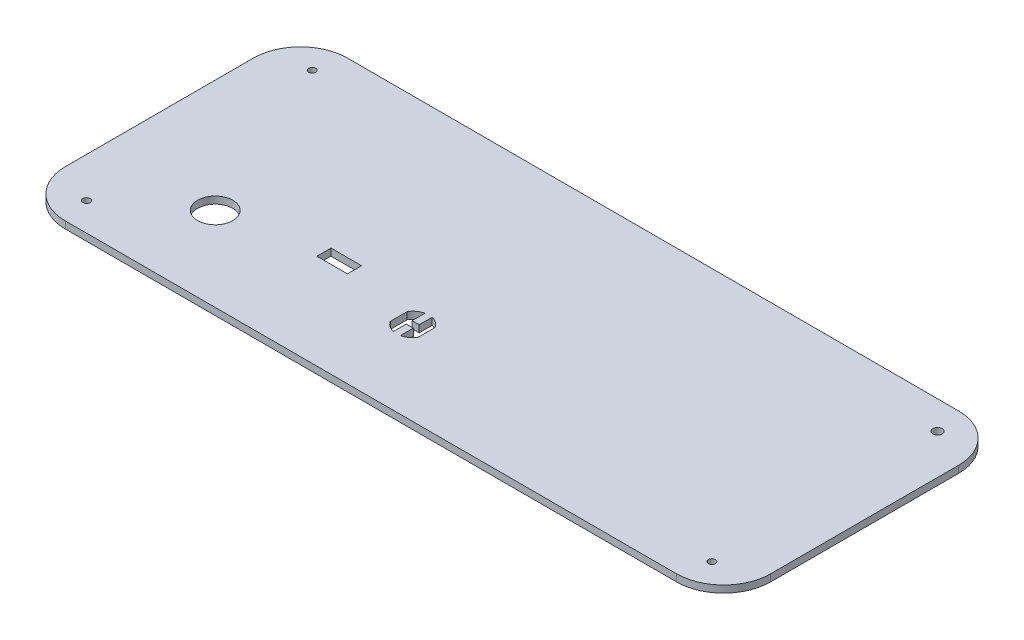
ISO-10303-21;
HEADER;
FILE_DESCRIPTION(('STEP AP214'),'2;1');
FILE_NAME('part.step','',(''),(''),'','','');
FILE_SCHEMA(('AUTOMOTIVE_DESIGN { 1 0 10303 214 1 1 1 1 }'));
ENDSEC;
DATA;
#1=APPLICATION_CONTEXT('core data for automotive mechanical design processes');
#2=APPLICATION_PROTOCOL_DEFINITION('international standard','automotive_design',2000,#1);
#3=PRODUCT_CONTEXT('',#1,'mechanical');
#4=PRODUCT('Part','Part','',(#3));
#5=PRODUCT_RELATED_PRODUCT_CATEGORY('part','',(#4));
#6=PRODUCT_DEFINITION_FORMATION('','',#4);
#7=PRODUCT_DEFINITION_CONTEXT('part definition',#1,'design');
#8=PRODUCT_DEFINITION('design','',#6,#7);
#9=PRODUCT_DEFINITION_SHAPE('','',#8);
#10=(LENGTH_UNIT() NAMED_UNIT(*) SI_UNIT(.MILLI.,.METRE.));
#11=(NAMED_UNIT(*) PLANE_ANGLE_UNIT() SI_UNIT($,.RADIAN.));
#12=(NAMED_UNIT(*) SI_UNIT($,.STERADIAN.) SOLID_ANGLE_UNIT());
#13=UNCERTAINTY_MEASURE_WITH_UNIT(LENGTH_MEASURE(1.E-05),#10,'distance_accuracy_value','');
#14=(GEOMETRIC_REPRESENTATION_CONTEXT(3) GLOBAL_UNCERTAINTY_ASSIGNED_CONTEXT((#13)) GLOBAL_UNIT_ASSIGNED_CONTEXT((#10,
#11,#12)) REPRESENTATION_CONTEXT('',''));
#15=CARTESIAN_POINT('',(0.,0.,0.));
#16=DIRECTION('',(0.,0.,1.));
#17=DIRECTION('',(1.,0.,0.));
#18=AXIS2_PLACEMENT_3D('',#15,#16,#17);
#19=CARTESIAN_POINT('',(0.,3.,0.));
#20=DIRECTION('',(0.,1.,0.));
#21=DIRECTION('',(0.,0.,1.));
#22=AXIS2_PLACEMENT_3D('',#19,#20,#21);
#23=PLANE('',#22);
#24=DIRECTION('',(0.,0.,-1.));
#25=VECTOR('',#24,1.);
#26=CARTESIAN_POINT('',(-200.5,3.,-46.4964857041005));
#27=LINE('',#26,#25);
#28=CARTESIAN_POINT('',(-200.5,3.,-40.4964857041005));
#29=VERTEX_POINT('',#28);
#30=CARTESIAN_POINT('',(-200.5,3.,-46.4964857041005));
#31=VERTEX_POINT('',#30);
#32=EDGE_CURVE('E208',#29,#31,#27,.T.);
#33=ORIENTED_EDGE('',*,*,#32,.F.);
#34=DIRECTION('',(1.,0.,0.));
#35=VECTOR('',#34,1.);
#36=CARTESIAN_POINT('',(-213.5,3.,-40.4964857041004));
#37=LINE('',#36,#35);
#38=CARTESIAN_POINT('',(-213.5,3.,-40.4964857041004));
#39=VERTEX_POINT('',#38);
#40=EDGE_CURVE('E198',#39,#29,#37,.T.);
#41=ORIENTED_EDGE('',*,*,#40,.F.);
#42=DIRECTION('',(0.,0.,1.));
#43=VECTOR('',#42,1.);
#44=CARTESIAN_POINT('',(-213.5,3.,-46.4964857041005));
#45=LINE('',#44,#43);
#46=CARTESIAN_POINT('',(-213.5,3.,-46.4964857041005));
#47=VERTEX_POINT('',#46);
#48=EDGE_CURVE('E224',#47,#39,#45,.T.);
#49=ORIENTED_EDGE('',*,*,#48,.F.);
#50=DIRECTION('',(-1.,0.,0.));
#51=VECTOR('',#50,1.);
#52=CARTESIAN_POINT('',(-213.5,3.,-46.4964857041005));
#53=LINE('',#52,#51);
#54=EDGE_CURVE('E222',#31,#47,#53,.T.);
#55=ORIENTED_EDGE('',*,*,#54,.F.);
#56=EDGE_LOOP('',(#33,#41,#49,#55));
#57=FACE_BOUND('',#56,.T.);
#58=DIRECTION('',(0.,0.,-1.));
#59=VECTOR('',#58,1.);
#60=CARTESIAN_POINT('',(-162.100000000001,3.,-39.3241944681029));
#61=LINE('',#60,#59);
#62=CARTESIAN_POINT('',(-162.100000000001,3.,-32.168776940098));
#63=VERTEX_POINT('',#62);
#64=CARTESIAN_POINT('',(-162.100000000001,3.,-39.3241944681029));
#65=VERTEX_POINT('',#64);
#66=EDGE_CURVE('E244',#63,#65,#61,.T.);
#67=ORIENTED_EDGE('',*,*,#66,.F.);
#68=CARTESIAN_POINT('',(-168.000000000001,3.,-35.7464857041005));
#69=DIRECTION('',(0.,1.,0.));
#70=DIRECTION('',(0.,0.,1.));
#71=AXIS2_PLACEMENT_3D('',#68,#69,#70);
#72=CIRCLE('',#71,6.90000000000143);
#73=CARTESIAN_POINT('',(-166.500000000001,3.,-29.0115024079059));
#74=VERTEX_POINT('',#73);
#75=EDGE_CURVE('E242',#74,#63,#72,.T.);
#76=ORIENTED_EDGE('',*,*,#75,.F.);
#77=DIRECTION('',(0.,0.,1.));
#78=VECTOR('',#77,1.);
#79=CARTESIAN_POINT('',(-166.500000000001,3.,-34.4964857041005));
#80=LINE('',#79,#78);
#81=CARTESIAN_POINT('',(-166.500000000001,3.,-34.4964857041005));
#82=VERTEX_POINT('',#81);
#83=EDGE_CURVE('E266',#82,#74,#80,.T.);
#84=ORIENTED_EDGE('',*,*,#83,.F.);
#85=DIRECTION('',(1.,0.,0.));
#86=VECTOR('',#85,1.);
#87=CARTESIAN_POINT('',(-169.500000000001,3.,-34.4964857041005));
#88=LINE('',#87,#86);
#89=CARTESIAN_POINT('',(-169.500000000001,3.,-34.4964857041005));
#90=VERTEX_POINT('',#89);
#91=EDGE_CURVE('E263',#90,#82,#88,.T.);
#92=ORIENTED_EDGE('',*,*,#91,.F.);
#93=DIRECTION('',(0.,0.,-1.));
#94=VECTOR('',#93,1.);
#95=CARTESIAN_POINT('',(-169.500000000001,3.,-34.4964857041005));
#96=LINE('',#95,#94);
#97=CARTESIAN_POINT('',(-169.500000000001,3.,-29.0115024079059));
#98=VERTEX_POINT('',#97);
#99=EDGE_CURVE('E261',#98,#90,#96,.T.);
#100=ORIENTED_EDGE('',*,*,#99,.F.);
#101=CARTESIAN_POINT('',(-168.000000000001,3.,-35.7464857041005));
#102=DIRECTION('',(0.,1.,0.));
#103=DIRECTION('',(0.,0.,1.));
#104=AXIS2_PLACEMENT_3D('',#101,#102,#103);
#105=CIRCLE('',#104,6.90000000000143);
#106=CARTESIAN_POINT('',(-173.900000000001,3.,-32.168776940098));
#107=VERTEX_POINT('',#106);
#108=EDGE_CURVE('E259',#107,#98,#105,.T.);
#109=ORIENTED_EDGE('',*,*,#108,.F.);
#110=DIRECTION('',(0.,0.,1.));
#111=VECTOR('',#110,1.);
#112=CARTESIAN_POINT('',(-173.900000000001,3.,-39.3241944681029));
#113=LINE('',#112,#111);
#114=CARTESIAN_POINT('',(-173.900000000001,3.,-39.3241944681029));
#115=VERTEX_POINT('',#114);
#116=EDGE_CURVE('E257',#115,#107,#113,.T.);
#117=ORIENTED_EDGE('',*,*,#116,.F.);
#118=CARTESIAN_POINT('',(-168.000000000001,3.,-35.7464857041005));
#119=DIRECTION('',(0.,1.,0.));
#120=DIRECTION('',(0.,0.,1.));
#121=AXIS2_PLACEMENT_3D('',#118,#119,#120);
#122=CIRCLE('',#121,6.90000000000143);
#123=CARTESIAN_POINT('',(-169.500000000001,3.,-42.481469000295));
#124=VERTEX_POINT('',#123);
#125=EDGE_CURVE('E255',#124,#115,#122,.T.);
#126=ORIENTED_EDGE('',*,*,#125,.F.);
#127=DIRECTION('',(0.,0.,-1.));
#128=VECTOR('',#127,1.);
#129=CARTESIAN_POINT('',(-169.500000000001,3.,-42.481469000295));
#130=LINE('',#129,#128);
#131=CARTESIAN_POINT('',(-169.500000000001,3.,-36.9964857041005));
#132=VERTEX_POINT('',#131);
#133=EDGE_CURVE('E253',#132,#124,#130,.T.);
#134=ORIENTED_EDGE('',*,*,#133,.F.);
#135=DIRECTION('',(-1.,0.,-2.91433543964101E-13));
#136=VECTOR('',#135,1.);
#137=CARTESIAN_POINT('',(-169.500000000001,3.,-36.9964857041005));
#138=LINE('',#137,#136);
#139=CARTESIAN_POINT('',(-166.500000000001,3.,-36.9964857040996));
#140=VERTEX_POINT('',#139);
#141=EDGE_CURVE('E251',#140,#132,#138,.T.);
#142=ORIENTED_EDGE('',*,*,#141,.F.);
#143=DIRECTION('',(0.,0.,1.));
#144=VECTOR('',#143,1.);
#145=CARTESIAN_POINT('',(-166.500000000001,3.,-42.481469000295));
#146=LINE('',#145,#144);
#147=CARTESIAN_POINT('',(-166.500000000001,3.,-42.481469000295));
#148=VERTEX_POINT('',#147);
#149=EDGE_CURVE('E249',#148,#140,#146,.T.);
#150=ORIENTED_EDGE('',*,*,#149,.F.);
#151=CARTESIAN_POINT('',(-168.000000000001,3.,-35.7464857041005));
#152=DIRECTION('',(0.,1.,0.));
#153=DIRECTION('',(0.,0.,1.));
#154=AXIS2_PLACEMENT_3D('',#151,#152,#153);
#155=CIRCLE('',#154,6.90000000000143);
#156=EDGE_CURVE('E247',#65,#148,#155,.T.);
#157=ORIENTED_EDGE('',*,*,#156,.F.);
#158=EDGE_LOOP('',(#67,#76,#84,#92,#100,#109,#117,#126,#134,#142,#150,#157));
#159=FACE_BOUND('',#158,.T.);
#160=CARTESIAN_POINT('',(-283.,3.,-12.));
#161=DIRECTION('',(0.,1.,0.));
#162=DIRECTION('',(0.,0.,1.));
#163=AXIS2_PLACEMENT_3D('',#160,#161,#162);
#164=CIRCLE('',#163,1.50000000000002);
#165=CARTESIAN_POINT('',(-283.,3.,-10.5));
#166=VERTEX_POINT('',#165);
#167=EDGE_CURVE('E329',#166,#166,#164,.T.);
#168=ORIENTED_EDGE('',*,*,#167,.F.);
#169=EDGE_LOOP('',(#168));
#170=FACE_BOUND('',#169,.T.);
#171=CARTESIAN_POINT('',(-17.,3.,-108.));
#172=DIRECTION('',(0.,1.,0.));
#173=DIRECTION('',(0.,0.,1.));
#174=AXIS2_PLACEMENT_3D('',#171,#172,#173);
#175=CIRCLE('',#174,2.);
#176=CARTESIAN_POINT('',(-17.,3.,-106.));
#177=VERTEX_POINT('',#176);
#178=EDGE_CURVE('E341',#177,#177,#175,.T.);
#179=ORIENTED_EDGE('',*,*,#178,.F.);
#180=EDGE_LOOP('',(#179));
#181=FACE_BOUND('',#180,.T.);
#182=DIRECTION('',(-1.,0.,0.));
#183=VECTOR('',#182,1.);
#184=CARTESIAN_POINT('',(0.,3.,-120.));
#185=LINE('',#184,#183);
#186=CARTESIAN_POINT('',(-20.,3.,-120.));
#187=VERTEX_POINT('',#186);
#188=CARTESIAN_POINT('',(-280.,3.,-120.));
#189=VERTEX_POINT('',#188);
#190=EDGE_CURVE('E356',#187,#189,#185,.T.);
#191=ORIENTED_EDGE('',*,*,#190,.T.);
#192=CARTESIAN_POINT('',(-280.,3.,-100.));
#193=DIRECTION('',(0.,1.,0.));
#194=DIRECTION('',(0.,0.,1.));
#195=AXIS2_PLACEMENT_3D('',#192,#193,#194);
#196=CIRCLE('',#195,20.);
#197=CARTESIAN_POINT('',(-300.,3.,-100.));
#198=VERTEX_POINT('',#197);
#199=EDGE_CURVE('E396',#189,#198,#196,.T.);
#200=ORIENTED_EDGE('',*,*,#199,.T.);
#201=DIRECTION('',(0.,0.,1.));
#202=VECTOR('',#201,1.);
#203=CARTESIAN_POINT('',(-300.,3.,0.));
#204=LINE('',#203,#202);
#205=CARTESIAN_POINT('',(-300.,3.,-20.));
#206=VERTEX_POINT('',#205);
#207=EDGE_CURVE('E360',#198,#206,#204,.T.);
#208=ORIENTED_EDGE('',*,*,#207,.T.);
#209=CARTESIAN_POINT('',(-280.,3.,-20.));
#210=DIRECTION('',(0.,1.,0.));
#211=DIRECTION('',(0.,0.,1.));
#212=AXIS2_PLACEMENT_3D('',#209,#210,#211);
#213=CIRCLE('',#212,20.);
#214=CARTESIAN_POINT('',(-280.,3.,0.));
#215=VERTEX_POINT('',#214);
#216=EDGE_CURVE('E56',#206,#215,#213,.T.);
#217=ORIENTED_EDGE('',*,*,#216,.T.);
#218=DIRECTION('',(1.,0.,0.));
#219=VECTOR('',#218,1.);
#220=CARTESIAN_POINT('',(0.,3.,0.));
#221=LINE('',#220,#219);
#222=CARTESIAN_POINT('',(-20.,3.,0.));
#223=VERTEX_POINT('',#222);
#224=EDGE_CURVE('E362',#215,#223,#221,.T.);
#225=ORIENTED_EDGE('',*,*,#224,.T.);
#226=CARTESIAN_POINT('',(-20.,3.,-20.));
#227=DIRECTION('',(0.,1.,0.));
#228=DIRECTION('',(0.,0.,1.));
#229=AXIS2_PLACEMENT_3D('',#226,#227,#228);
#230=CIRCLE('',#229,20.);
#231=CARTESIAN_POINT('',(0.,3.,-20.));
#232=VERTEX_POINT('',#231);
#233=EDGE_CURVE('E392',#223,#232,#230,.T.);
#234=ORIENTED_EDGE('',*,*,#233,.T.);
#235=DIRECTION('',(0.,0.,-1.));
#236=VECTOR('',#235,1.);
#237=CARTESIAN_POINT('',(0.,3.,0.));
#238=LINE('',#237,#236);
#239=CARTESIAN_POINT('',(0.,3.,-100.));
#240=VERTEX_POINT('',#239);
#241=EDGE_CURVE('E353',#232,#240,#238,.T.);
#242=ORIENTED_EDGE('',*,*,#241,.T.);
#243=CARTESIAN_POINT('',(-20.,3.,-100.));
#244=DIRECTION('',(0.,1.,0.));
#245=DIRECTION('',(0.,0.,1.));
#246=AXIS2_PLACEMENT_3D('',#243,#244,#245);
#247=CIRCLE('',#246,20.);
#248=EDGE_CURVE('E394',#240,#187,#247,.T.);
#249=ORIENTED_EDGE('',*,*,#248,.T.);
#250=EDGE_LOOP('',(#191,#200,#208,#217,#225,#234,#242,#249));
#251=FACE_BOUND('',#250,.T.);
#252=CARTESIAN_POINT('',(-283.,3.,-108.));
#253=DIRECTION('',(0.,1.,0.));
#254=DIRECTION('',(0.,0.,1.));
#255=AXIS2_PLACEMENT_3D('',#252,#253,#254);
#256=CIRCLE('',#255,1.50000000000002);
#257=CARTESIAN_POINT('',(-283.,3.,-106.5));
#258=VERTEX_POINT('',#257);
#259=EDGE_CURVE('E347',#258,#258,#256,.T.);
#260=ORIENTED_EDGE('',*,*,#259,.F.);
#261=EDGE_LOOP('',(#260));
#262=FACE_BOUND('',#261,.T.);
#263=CARTESIAN_POINT('',(-17.,3.,-12.0000000000001));
#264=DIRECTION('',(0.,1.,0.));
#265=DIRECTION('',(0.,0.,1.));
#266=AXIS2_PLACEMENT_3D('',#263,#264,#265);
#267=CIRCLE('',#266,1.5);
#268=CARTESIAN_POINT('',(-17.,3.,-10.5000000000001));
#269=VERTEX_POINT('',#268);
#270=EDGE_CURVE('E335',#269,#269,#267,.T.);
#271=ORIENTED_EDGE('',*,*,#270,.F.);
#272=EDGE_LOOP('',(#271));
#273=FACE_BOUND('',#272,.T.);
#274=CARTESIAN_POINT('',(-252.000000000001,3.,-35.7464857041005));
#275=DIRECTION('',(0.,1.,0.));
#276=DIRECTION('',(0.,0.,1.));
#277=AXIS2_PLACEMENT_3D('',#274,#275,#276);
#278=CIRCLE('',#277,7.50000000000139);
#279=CARTESIAN_POINT('',(-252.000000000001,3.,-28.2464857040991));
#280=VERTEX_POINT('',#279);
#281=EDGE_CURVE('E231',#280,#280,#278,.T.);
#282=ORIENTED_EDGE('',*,*,#281,.F.);
#283=EDGE_LOOP('',(#282));
#284=FACE_BOUND('',#283,.T.);
#285=ADVANCED_FACE('F36',(#57,#159,#170,#181,#251,#262,#273,#284),#23,.T.);
#286=CARTESIAN_POINT('',(0.,0.,0.));
#287=DIRECTION('',(0.,1.,0.));
#288=DIRECTION('',(0.,0.,1.));
#289=AXIS2_PLACEMENT_3D('',#286,#287,#288);
#290=PLANE('',#289);
#291=CARTESIAN_POINT('',(-168.000000000001,0.,-35.7464857041005));
#292=DIRECTION('',(0.,1.,0.));
#293=DIRECTION('',(0.,0.,1.));
#294=AXIS2_PLACEMENT_3D('',#291,#292,#293);
#295=CIRCLE('',#294,6.90000000000143);
#296=CARTESIAN_POINT('',(-166.500000000001,0.,-29.0115024079059));
#297=VERTEX_POINT('',#296);
#298=CARTESIAN_POINT('',(-162.100000000001,0.,-32.168776940098));
#299=VERTEX_POINT('',#298);
#300=EDGE_CURVE('E216',#297,#299,#295,.T.);
#301=ORIENTED_EDGE('',*,*,#300,.T.);
#302=DIRECTION('',(0.,0.,-1.));
#303=VECTOR('',#302,1.);
#304=CARTESIAN_POINT('',(-162.100000000001,0.,-39.3241944681029));
#305=LINE('',#304,#303);
#306=CARTESIAN_POINT('',(-162.100000000001,0.,-39.3241944681029));
#307=VERTEX_POINT('',#306);
#308=EDGE_CURVE('E271',#299,#307,#305,.T.);
#309=ORIENTED_EDGE('',*,*,#308,.T.);
#310=CARTESIAN_POINT('',(-168.000000000001,0.,-35.7464857041005));
#311=DIRECTION('',(0.,1.,0.));
#312=DIRECTION('',(0.,0.,1.));
#313=AXIS2_PLACEMENT_3D('',#310,#311,#312);
#314=CIRCLE('',#313,6.90000000000143);
#315=CARTESIAN_POINT('',(-166.500000000001,0.,-42.481469000295));
#316=VERTEX_POINT('',#315);
#317=EDGE_CURVE('E274',#307,#316,#314,.T.);
#318=ORIENTED_EDGE('',*,*,#317,.T.);
#319=DIRECTION('',(0.,0.,1.));
#320=VECTOR('',#319,1.);
#321=CARTESIAN_POINT('',(-166.500000000001,0.,-42.481469000295));
#322=LINE('',#321,#320);
#323=CARTESIAN_POINT('',(-166.500000000001,0.,-36.9964857040996));
#324=VERTEX_POINT('',#323);
#325=EDGE_CURVE('E277',#316,#324,#322,.T.);
#326=ORIENTED_EDGE('',*,*,#325,.T.);
#327=DIRECTION('',(-1.,0.,-2.91433543964101E-13));
#328=VECTOR('',#327,1.);
#329=CARTESIAN_POINT('',(-169.500000000001,0.,-36.9964857041005));
#330=LINE('',#329,#328);
#331=CARTESIAN_POINT('',(-169.500000000001,0.,-36.9964857041005));
#332=VERTEX_POINT('',#331);
#333=EDGE_CURVE('E280',#324,#332,#330,.T.);
#334=ORIENTED_EDGE('',*,*,#333,.T.);
#335=DIRECTION('',(0.,0.,-1.));
#336=VECTOR('',#335,1.);
#337=CARTESIAN_POINT('',(-169.500000000001,0.,-42.481469000295));
#338=LINE('',#337,#336);
#339=CARTESIAN_POINT('',(-169.500000000001,0.,-42.481469000295));
#340=VERTEX_POINT('',#339);
#341=EDGE_CURVE('E283',#332,#340,#338,.T.);
#342=ORIENTED_EDGE('',*,*,#341,.T.);
#343=CARTESIAN_POINT('',(-168.000000000001,0.,-35.7464857041005));
#344=DIRECTION('',(0.,1.,0.));
#345=DIRECTION('',(0.,0.,1.));
#346=AXIS2_PLACEMENT_3D('',#343,#344,#345);
#347=CIRCLE('',#346,6.90000000000143);
#348=CARTESIAN_POINT('',(-173.900000000001,0.,-39.3241944681029));
#349=VERTEX_POINT('',#348);
#350=EDGE_CURVE('E286',#340,#349,#347,.T.);
#351=ORIENTED_EDGE('',*,*,#350,.T.);
#352=DIRECTION('',(0.,0.,1.));
#353=VECTOR('',#352,1.);
#354=CARTESIAN_POINT('',(-173.900000000001,0.,-39.3241944681029));
#355=LINE('',#354,#353);
#356=CARTESIAN_POINT('',(-173.900000000001,0.,-32.168776940098));
#357=VERTEX_POINT('',#356);
#358=EDGE_CURVE('E289',#349,#357,#355,.T.);
#359=ORIENTED_EDGE('',*,*,#358,.T.);
#360=CARTESIAN_POINT('',(-168.000000000001,0.,-35.7464857041005));
#361=DIRECTION('',(0.,1.,0.));
#362=DIRECTION('',(0.,0.,1.));
#363=AXIS2_PLACEMENT_3D('',#360,#361,#362);
#364=CIRCLE('',#363,6.90000000000143);
#365=CARTESIAN_POINT('',(-169.500000000001,0.,-29.0115024079059));
#366=VERTEX_POINT('',#365);
#367=EDGE_CURVE('E292',#357,#366,#364,.T.);
#368=ORIENTED_EDGE('',*,*,#367,.T.);
#369=DIRECTION('',(0.,0.,-1.));
#370=VECTOR('',#369,1.);
#371=CARTESIAN_POINT('',(-169.500000000001,0.,-34.4964857041005));
#372=LINE('',#371,#370);
#373=CARTESIAN_POINT('',(-169.500000000001,0.,-34.4964857041005));
#374=VERTEX_POINT('',#373);
#375=EDGE_CURVE('E295',#366,#374,#372,.T.);
#376=ORIENTED_EDGE('',*,*,#375,.T.);
#377=DIRECTION('',(1.,0.,0.));
#378=VECTOR('',#377,1.);
#379=CARTESIAN_POINT('',(-169.500000000001,0.,-34.4964857041005));
#380=LINE('',#379,#378);
#381=CARTESIAN_POINT('',(-166.500000000001,0.,-34.4964857041005));
#382=VERTEX_POINT('',#381);
#383=EDGE_CURVE('E298',#374,#382,#380,.T.);
#384=ORIENTED_EDGE('',*,*,#383,.T.);
#385=DIRECTION('',(0.,0.,1.));
#386=VECTOR('',#385,1.);
#387=CARTESIAN_POINT('',(-166.500000000001,0.,-34.4964857041005));
#388=LINE('',#387,#386);
#389=EDGE_CURVE('E245',#382,#297,#388,.T.);
#390=ORIENTED_EDGE('',*,*,#389,.T.);
#391=EDGE_LOOP('',(#301,#309,#318,#326,#334,#342,#351,#359,#368,#376,#384,#390));
#392=FACE_BOUND('',#391,.T.);
#393=DIRECTION('',(0.,0.,1.));
#394=VECTOR('',#393,1.);
#395=CARTESIAN_POINT('',(-300.,0.,0.));
#396=LINE('',#395,#394);
#397=CARTESIAN_POINT('',(-300.,0.,-100.));
#398=VERTEX_POINT('',#397);
#399=CARTESIAN_POINT('',(-300.,0.,-20.));
#400=VERTEX_POINT('',#399);
#401=EDGE_CURVE('E370',#398,#400,#396,.T.);
#402=ORIENTED_EDGE('',*,*,#401,.F.);
#403=CARTESIAN_POINT('',(-280.,0.,-100.));
#404=DIRECTION('',(0.,1.,0.));
#405=DIRECTION('',(0.,0.,1.));
#406=AXIS2_PLACEMENT_3D('',#403,#404,#405);
#407=CIRCLE('',#406,20.);
#408=CARTESIAN_POINT('',(-280.,0.,-120.));
#409=VERTEX_POINT('',#408);
#410=EDGE_CURVE('E384',#398,#409,#407,.F.);
#411=ORIENTED_EDGE('',*,*,#410,.T.);
#412=DIRECTION('',(-1.,0.,0.));
#413=VECTOR('',#412,1.);
#414=CARTESIAN_POINT('',(0.,0.,-120.));
#415=LINE('',#414,#413);
#416=CARTESIAN_POINT('',(-20.,0.,-120.));
#417=VERTEX_POINT('',#416);
#418=EDGE_CURVE('E367',#417,#409,#415,.T.);
#419=ORIENTED_EDGE('',*,*,#418,.F.);
#420=CARTESIAN_POINT('',(-20.,0.,-100.));
#421=DIRECTION('',(0.,1.,0.));
#422=DIRECTION('',(0.,0.,1.));
#423=AXIS2_PLACEMENT_3D('',#420,#421,#422);
#424=CIRCLE('',#423,20.);
#425=CARTESIAN_POINT('',(0.,0.,-100.));
#426=VERTEX_POINT('',#425);
#427=EDGE_CURVE('E382',#417,#426,#424,.F.);
#428=ORIENTED_EDGE('',*,*,#427,.T.);
#429=DIRECTION('',(0.,0.,-1.));
#430=VECTOR('',#429,1.);
#431=CARTESIAN_POINT('',(0.,0.,0.));
#432=LINE('',#431,#430);
#433=CARTESIAN_POINT('',(0.,0.,-20.));
#434=VERTEX_POINT('',#433);
#435=EDGE_CURVE('E350',#434,#426,#432,.T.);
#436=ORIENTED_EDGE('',*,*,#435,.F.);
#437=CARTESIAN_POINT('',(-20.,0.,-20.));
#438=DIRECTION('',(0.,1.,0.));
#439=DIRECTION('',(0.,0.,1.));
#440=AXIS2_PLACEMENT_3D('',#437,#438,#439);
#441=CIRCLE('',#440,20.);
#442=CARTESIAN_POINT('',(-20.,0.,0.));
#443=VERTEX_POINT('',#442);
#444=EDGE_CURVE('E380',#434,#443,#441,.F.);
#445=ORIENTED_EDGE('',*,*,#444,.T.);
#446=DIRECTION('',(1.,0.,0.));
#447=VECTOR('',#446,1.);
#448=CARTESIAN_POINT('',(0.,0.,0.));
#449=LINE('',#448,#447);
#450=CARTESIAN_POINT('',(-280.,0.,0.));
#451=VERTEX_POINT('',#450);
#452=EDGE_CURVE('E357',#451,#443,#449,.T.);
#453=ORIENTED_EDGE('',*,*,#452,.F.);
#454=CARTESIAN_POINT('',(-280.,0.,-20.));
#455=DIRECTION('',(0.,1.,0.));
#456=DIRECTION('',(0.,0.,1.));
#457=AXIS2_PLACEMENT_3D('',#454,#455,#456);
#458=CIRCLE('',#457,20.);
#459=EDGE_CURVE('E378',#451,#400,#458,.F.);
#460=ORIENTED_EDGE('',*,*,#459,.T.);
#461=EDGE_LOOP('',(#402,#411,#419,#428,#436,#445,#453,#460));
#462=FACE_BOUND('',#461,.T.);
#463=CARTESIAN_POINT('',(-283.,0.,-108.));
#464=DIRECTION('',(0.,1.,0.));
#465=DIRECTION('',(0.,0.,1.));
#466=AXIS2_PLACEMENT_3D('',#463,#464,#465);
#467=CIRCLE('',#466,1.50000000000002);
#468=CARTESIAN_POINT('',(-283.,0.,-106.5));
#469=VERTEX_POINT('',#468);
#470=EDGE_CURVE('E344',#469,#469,#467,.T.);
#471=ORIENTED_EDGE('',*,*,#470,.T.);
#472=EDGE_LOOP('',(#471));
#473=FACE_BOUND('',#472,.T.);
#474=CARTESIAN_POINT('',(-17.,0.,-108.));
#475=DIRECTION('',(0.,1.,0.));
#476=DIRECTION('',(0.,0.,1.));
#477=AXIS2_PLACEMENT_3D('',#474,#475,#476);
#478=CIRCLE('',#477,2.);
#479=CARTESIAN_POINT('',(-17.,0.,-106.));
#480=VERTEX_POINT('',#479);
#481=EDGE_CURVE('E338',#480,#480,#478,.T.);
#482=ORIENTED_EDGE('',*,*,#481,.T.);
#483=EDGE_LOOP('',(#482));
#484=FACE_BOUND('',#483,.T.);
#485=CARTESIAN_POINT('',(-17.,0.,-12.0000000000001));
#486=DIRECTION('',(0.,1.,0.));
#487=DIRECTION('',(0.,0.,1.));
#488=AXIS2_PLACEMENT_3D('',#485,#486,#487);
#489=CIRCLE('',#488,1.5);
#490=CARTESIAN_POINT('',(-17.,0.,-10.5000000000001));
#491=VERTEX_POINT('',#490);
#492=EDGE_CURVE('E332',#491,#491,#489,.T.);
#493=ORIENTED_EDGE('',*,*,#492,.T.);
#494=EDGE_LOOP('',(#493));
#495=FACE_BOUND('',#494,.T.);
#496=CARTESIAN_POINT('',(-283.,0.,-12.));
#497=DIRECTION('',(0.,1.,0.));
#498=DIRECTION('',(0.,0.,1.));
#499=AXIS2_PLACEMENT_3D('',#496,#497,#498);
#500=CIRCLE('',#499,1.50000000000002);
#501=CARTESIAN_POINT('',(-283.,0.,-10.5));
#502=VERTEX_POINT('',#501);
#503=EDGE_CURVE('E328',#502,#502,#500,.T.);
#504=ORIENTED_EDGE('',*,*,#503,.T.);
#505=EDGE_LOOP('',(#504));
#506=FACE_BOUND('',#505,.T.);
#507=DIRECTION('',(1.,0.,0.));
#508=VECTOR('',#507,1.);
#509=CARTESIAN_POINT('',(-213.5,0.,-40.4964857041004));
#510=LINE('',#509,#508);
#511=CARTESIAN_POINT('',(-213.5,0.,-40.4964857041004));
#512=VERTEX_POINT('',#511);
#513=CARTESIAN_POINT('',(-200.5,0.,-40.4964857041005));
#514=VERTEX_POINT('',#513);
#515=EDGE_CURVE('E229',#512,#514,#510,.T.);
#516=ORIENTED_EDGE('',*,*,#515,.T.);
#517=DIRECTION('',(0.,0.,-1.));
#518=VECTOR('',#517,1.);
#519=CARTESIAN_POINT('',(-200.5,0.,-46.4964857041005));
#520=LINE('',#519,#518);
#521=CARTESIAN_POINT('',(-200.5,0.,-46.4964857041005));
#522=VERTEX_POINT('',#521);
#523=EDGE_CURVE('E215',#514,#522,#520,.T.);
#524=ORIENTED_EDGE('',*,*,#523,.T.);
#525=DIRECTION('',(-1.,0.,0.));
#526=VECTOR('',#525,1.);
#527=CARTESIAN_POINT('',(-213.5,0.,-46.4964857041005));
#528=LINE('',#527,#526);
#529=CARTESIAN_POINT('',(-213.5,0.,-46.4964857041005));
#530=VERTEX_POINT('',#529);
#531=EDGE_CURVE('E233',#522,#530,#528,.T.);
#532=ORIENTED_EDGE('',*,*,#531,.T.);
#533=DIRECTION('',(0.,0.,1.));
#534=VECTOR('',#533,1.);
#535=CARTESIAN_POINT('',(-213.5,0.,-46.4964857041005));
#536=LINE('',#535,#534);
#537=EDGE_CURVE('E209',#530,#512,#536,.T.);
#538=ORIENTED_EDGE('',*,*,#537,.T.);
#539=EDGE_LOOP('',(#516,#524,#532,#538));
#540=FACE_BOUND('',#539,.T.);
#541=CARTESIAN_POINT('',(-252.000000000001,0.,-35.7464857041005));
#542=DIRECTION('',(0.,1.,0.));
#543=DIRECTION('',(0.,0.,1.));
#544=AXIS2_PLACEMENT_3D('',#541,#542,#543);
#545=CIRCLE('',#544,7.50000000000139);
#546=CARTESIAN_POINT('',(-252.000000000001,0.,-28.2464857040991));
#547=VERTEX_POINT('',#546);
#548=EDGE_CURVE('E736',#547,#547,#545,.T.);
#549=ORIENTED_EDGE('',*,*,#548,.T.);
#550=EDGE_LOOP('',(#549));
#551=FACE_BOUND('',#550,.T.);
#552=ADVANCED_FACE('F409',(#392,#462,#473,#484,#495,#506,#540,#551),#290,.F.);
#553=CARTESIAN_POINT('',(0.,3.,0.));
#554=DIRECTION('',(-1.,0.,0.));
#555=DIRECTION('',(0.,0.,1.));
#556=AXIS2_PLACEMENT_3D('',#553,#554,#555);
#557=PLANE('',#556);
#558=ORIENTED_EDGE('',*,*,#435,.T.);
#559=DIRECTION('',(0.,-1.,0.));
#560=VECTOR('',#559,1.);
#561=CARTESIAN_POINT('',(0.,3.,-100.));
#562=LINE('',#561,#560);
#563=EDGE_CURVE('E401',#426,#240,#562,.F.);
#564=ORIENTED_EDGE('',*,*,#563,.T.);
#565=ORIENTED_EDGE('',*,*,#241,.F.);
#566=DIRECTION('',(0.,-1.,0.));
#567=VECTOR('',#566,1.);
#568=CARTESIAN_POINT('',(0.,3.,-20.));
#569=LINE('',#568,#567);
#570=EDGE_CURVE('E398',#232,#434,#569,.T.);
#571=ORIENTED_EDGE('',*,*,#570,.T.);
#572=EDGE_LOOP('',(#558,#564,#565,#571));
#573=FACE_BOUND('',#572,.T.);
#574=ADVANCED_FACE('F418',(#573),#557,.F.);
#575=CARTESIAN_POINT('',(0.,3.,-120.));
#576=DIRECTION('',(0.,0.,1.));
#577=DIRECTION('',(1.,0.,0.));
#578=AXIS2_PLACEMENT_3D('',#575,#576,#577);
#579=PLANE('',#578);
#580=ORIENTED_EDGE('',*,*,#418,.T.);
#581=DIRECTION('',(0.,-1.,0.));
#582=VECTOR('',#581,1.);
#583=CARTESIAN_POINT('',(-280.,3.,-120.));
#584=LINE('',#583,#582);
#585=EDGE_CURVE('E389',#409,#189,#584,.F.);
#586=ORIENTED_EDGE('',*,*,#585,.T.);
#587=ORIENTED_EDGE('',*,*,#190,.F.);
#588=DIRECTION('',(0.,-1.,0.));
#589=VECTOR('',#588,1.);
#590=CARTESIAN_POINT('',(-20.,3.,-120.));
#591=LINE('',#590,#589);
#592=EDGE_CURVE('E386',#187,#417,#591,.T.);
#593=ORIENTED_EDGE('',*,*,#592,.T.);
#594=EDGE_LOOP('',(#580,#586,#587,#593));
#595=FACE_BOUND('',#594,.T.);
#596=ADVANCED_FACE('F428',(#595),#579,.F.);
#597=CARTESIAN_POINT('',(-300.,3.,0.));
#598=DIRECTION('',(1.,0.,0.));
#599=DIRECTION('',(0.,0.,-1.));
#600=AXIS2_PLACEMENT_3D('',#597,#598,#599);
#601=PLANE('',#600);
#602=ORIENTED_EDGE('',*,*,#207,.F.);
#603=DIRECTION('',(0.,-1.,0.));
#604=VECTOR('',#603,1.);
#605=CARTESIAN_POINT('',(-300.,3.,-100.));
#606=LINE('',#605,#604);
#607=EDGE_CURVE('E375',#198,#398,#606,.T.);
#608=ORIENTED_EDGE('',*,*,#607,.T.);
#609=ORIENTED_EDGE('',*,*,#401,.T.);
#610=DIRECTION('',(0.,-1.,0.));
#611=VECTOR('',#610,1.);
#612=CARTESIAN_POINT('',(-300.,3.,-20.));
#613=LINE('',#612,#611);
#614=EDGE_CURVE('E364',#400,#206,#613,.F.);
#615=ORIENTED_EDGE('',*,*,#614,.T.);
#616=EDGE_LOOP('',(#602,#608,#609,#615));
#617=FACE_BOUND('',#616,.T.);
#618=ADVANCED_FACE('F436',(#617),#601,.F.);
#619=CARTESIAN_POINT('',(0.,3.,0.));
#620=DIRECTION('',(0.,0.,-1.));
#621=DIRECTION('',(-1.,0.,0.));
#622=AXIS2_PLACEMENT_3D('',#619,#620,#621);
#623=PLANE('',#622);
#624=ORIENTED_EDGE('',*,*,#452,.T.);
#625=DIRECTION('',(0.,-1.,0.));
#626=VECTOR('',#625,1.);
#627=CARTESIAN_POINT('',(-20.,3.,0.));
#628=LINE('',#627,#626);
#629=EDGE_CURVE('E11',#443,#223,#628,.F.);
#630=ORIENTED_EDGE('',*,*,#629,.T.);
#631=ORIENTED_EDGE('',*,*,#224,.F.);
#632=DIRECTION('',(0.,-1.,0.));
#633=VECTOR('',#632,1.);
#634=CARTESIAN_POINT('',(-280.,3.,0.));
#635=LINE('',#634,#633);
#636=EDGE_CURVE('E44',#215,#451,#635,.T.);
#637=ORIENTED_EDGE('',*,*,#636,.T.);
#638=EDGE_LOOP('',(#624,#630,#631,#637));
#639=FACE_BOUND('',#638,.T.);
#640=ADVANCED_FACE('F405',(#639),#623,.F.);
#641=CARTESIAN_POINT('',(-283.,3.,-108.));
#642=DIRECTION('',(0.,-1.,0.));
#643=DIRECTION('',(0.,0.,-1.));
#644=AXIS2_PLACEMENT_3D('',#641,#642,#643);
#645=CYLINDRICAL_SURFACE('',#644,1.50000000000002);
#646=ORIENTED_EDGE('',*,*,#259,.T.);
#647=EDGE_LOOP('',(#646));
#648=FACE_BOUND('',#647,.T.);
#649=ORIENTED_EDGE('',*,*,#470,.F.);
#650=EDGE_LOOP('',(#649));
#651=FACE_BOUND('',#650,.T.);
#652=ADVANCED_FACE('F450',(#648,#651),#645,.F.);
#653=CARTESIAN_POINT('',(-17.,3.,-108.));
#654=DIRECTION('',(0.,-1.,0.));
#655=DIRECTION('',(0.,0.,-1.));
#656=AXIS2_PLACEMENT_3D('',#653,#654,#655);
#657=CYLINDRICAL_SURFACE('',#656,2.);
#658=ORIENTED_EDGE('',*,*,#178,.T.);
#659=EDGE_LOOP('',(#658));
#660=FACE_BOUND('',#659,.T.);
#661=ORIENTED_EDGE('',*,*,#481,.F.);
#662=EDGE_LOOP('',(#661));
#663=FACE_BOUND('',#662,.T.);
#664=ADVANCED_FACE('F652',(#660,#663),#657,.F.);
#665=CARTESIAN_POINT('',(-17.,3.,-12.0000000000001));
#666=DIRECTION('',(0.,-1.,0.));
#667=DIRECTION('',(0.,0.,-1.));
#668=AXIS2_PLACEMENT_3D('',#665,#666,#667);
#669=CYLINDRICAL_SURFACE('',#668,1.5);
#670=ORIENTED_EDGE('',*,*,#270,.T.);
#671=EDGE_LOOP('',(#670));
#672=FACE_BOUND('',#671,.T.);
#673=ORIENTED_EDGE('',*,*,#492,.F.);
#674=EDGE_LOOP('',(#673));
#675=FACE_BOUND('',#674,.T.);
#676=ADVANCED_FACE('F643',(#672,#675),#669,.F.);
#677=CARTESIAN_POINT('',(-283.,3.,-12.));
#678=DIRECTION('',(0.,-1.,0.));
#679=DIRECTION('',(0.,0.,-1.));
#680=AXIS2_PLACEMENT_3D('',#677,#678,#679);
#681=CYLINDRICAL_SURFACE('',#680,1.50000000000002);
#682=ORIENTED_EDGE('',*,*,#167,.T.);
#683=EDGE_LOOP('',(#682));
#684=FACE_BOUND('',#683,.T.);
#685=ORIENTED_EDGE('',*,*,#503,.F.);
#686=EDGE_LOOP('',(#685));
#687=FACE_BOUND('',#686,.T.);
#688=ADVANCED_FACE('F634',(#684,#687),#681,.F.);
#689=CARTESIAN_POINT('',(-168.000000000001,3.,-35.7464857041005));
#690=DIRECTION('',(0.,-1.,0.));
#691=DIRECTION('',(0.,0.,-1.));
#692=AXIS2_PLACEMENT_3D('',#689,#690,#691);
#693=CYLINDRICAL_SURFACE('',#692,6.90000000000143);
#694=ORIENTED_EDGE('',*,*,#300,.F.);
#695=DIRECTION('',(0.,-1.,0.));
#696=VECTOR('',#695,1.);
#697=CARTESIAN_POINT('',(-166.500000000001,3.,-29.0115024079059));
#698=LINE('',#697,#696);
#699=EDGE_CURVE('E268',#74,#297,#698,.T.);
#700=ORIENTED_EDGE('',*,*,#699,.F.);
#701=ORIENTED_EDGE('',*,*,#75,.T.);
#702=DIRECTION('',(0.,-1.,0.));
#703=VECTOR('',#702,1.);
#704=CARTESIAN_POINT('',(-162.100000000001,3.,-32.168776940098));
#705=LINE('',#704,#703);
#706=EDGE_CURVE('E325',#63,#299,#705,.T.);
#707=ORIENTED_EDGE('',*,*,#706,.T.);
#708=EDGE_LOOP('',(#694,#700,#701,#707));
#709=FACE_BOUND('',#708,.T.);
#710=ADVANCED_FACE('F625',(#709),#693,.F.);
#711=CARTESIAN_POINT('',(-162.100000000001,3.,-39.3241944681029));
#712=DIRECTION('',(-1.,0.,0.));
#713=DIRECTION('',(0.,0.,1.));
#714=AXIS2_PLACEMENT_3D('',#711,#712,#713);
#715=PLANE('',#714);
#716=ORIENTED_EDGE('',*,*,#308,.F.);
#717=ORIENTED_EDGE('',*,*,#706,.F.);
#718=ORIENTED_EDGE('',*,*,#66,.T.);
#719=DIRECTION('',(0.,-1.,0.));
#720=VECTOR('',#719,1.);
#721=CARTESIAN_POINT('',(-162.100000000001,3.,-39.3241944681029));
#722=LINE('',#721,#720);
#723=EDGE_CURVE('E323',#65,#307,#722,.T.);
#724=ORIENTED_EDGE('',*,*,#723,.T.);
#725=EDGE_LOOP('',(#716,#717,#718,#724));
#726=FACE_BOUND('',#725,.T.);
#727=ADVANCED_FACE('F616',(#726),#715,.T.);
#728=CARTESIAN_POINT('',(-168.000000000001,3.,-35.7464857041005));
#729=DIRECTION('',(0.,-1.,0.));
#730=DIRECTION('',(0.,0.,-1.));
#731=AXIS2_PLACEMENT_3D('',#728,#729,#730);
#732=CYLINDRICAL_SURFACE('',#731,6.90000000000143);
#733=ORIENTED_EDGE('',*,*,#317,.F.);
#734=ORIENTED_EDGE('',*,*,#723,.F.);
#735=ORIENTED_EDGE('',*,*,#156,.T.);
#736=DIRECTION('',(0.,-1.,0.));
#737=VECTOR('',#736,1.);
#738=CARTESIAN_POINT('',(-166.500000000001,3.,-42.481469000295));
#739=LINE('',#738,#737);
#740=EDGE_CURVE('E321',#148,#316,#739,.T.);
#741=ORIENTED_EDGE('',*,*,#740,.T.);
#742=EDGE_LOOP('',(#733,#734,#735,#741));
#743=FACE_BOUND('',#742,.T.);
#744=ADVANCED_FACE('F607',(#743),#732,.F.);
#745=CARTESIAN_POINT('',(-166.500000000001,3.,-42.481469000295));
#746=DIRECTION('',(1.,0.,0.));
#747=DIRECTION('',(0.,0.,-1.));
#748=AXIS2_PLACEMENT_3D('',#745,#746,#747);
#749=PLANE('',#748);
#750=ORIENTED_EDGE('',*,*,#325,.F.);
#751=ORIENTED_EDGE('',*,*,#740,.F.);
#752=ORIENTED_EDGE('',*,*,#149,.T.);
#753=DIRECTION('',(0.,-1.,0.));
#754=VECTOR('',#753,1.);
#755=CARTESIAN_POINT('',(-166.500000000001,3.,-36.9964857040996));
#756=LINE('',#755,#754);
#757=EDGE_CURVE('E319',#140,#324,#756,.T.);
#758=ORIENTED_EDGE('',*,*,#757,.T.);
#759=EDGE_LOOP('',(#750,#751,#752,#758));
#760=FACE_BOUND('',#759,.T.);
#761=ADVANCED_FACE('F598',(#760),#749,.T.);
#762=CARTESIAN_POINT('',(-169.500000000001,3.,-36.9964857041005));
#763=DIRECTION('',(-2.91433543964101E-13,0.,1.));
#764=DIRECTION('',(1.,0.,2.91433543964101E-13));
#765=AXIS2_PLACEMENT_3D('',#762,#763,#764);
#766=PLANE('',#765);
#767=ORIENTED_EDGE('',*,*,#333,.F.);
#768=ORIENTED_EDGE('',*,*,#757,.F.);
#769=ORIENTED_EDGE('',*,*,#141,.T.);
#770=DIRECTION('',(0.,-1.,0.));
#771=VECTOR('',#770,1.);
#772=CARTESIAN_POINT('',(-169.500000000001,3.,-36.9964857041005));
#773=LINE('',#772,#771);
#774=EDGE_CURVE('E317',#132,#332,#773,.T.);
#775=ORIENTED_EDGE('',*,*,#774,.T.);
#776=EDGE_LOOP('',(#767,#768,#769,#775));
#777=FACE_BOUND('',#776,.T.);
#778=ADVANCED_FACE('F589',(#777),#766,.T.);
#779=CARTESIAN_POINT('',(-169.500000000001,3.,-42.481469000295));
#780=DIRECTION('',(-1.,0.,0.));
#781=DIRECTION('',(0.,0.,1.));
#782=AXIS2_PLACEMENT_3D('',#779,#780,#781);
#783=PLANE('',#782);
#784=ORIENTED_EDGE('',*,*,#341,.F.);
#785=ORIENTED_EDGE('',*,*,#774,.F.);
#786=ORIENTED_EDGE('',*,*,#133,.T.);
#787=DIRECTION('',(0.,-1.,0.));
#788=VECTOR('',#787,1.);
#789=CARTESIAN_POINT('',(-169.500000000001,3.,-42.481469000295));
#790=LINE('',#789,#788);
#791=EDGE_CURVE('E315',#124,#340,#790,.T.);
#792=ORIENTED_EDGE('',*,*,#791,.T.);
#793=EDGE_LOOP('',(#784,#785,#786,#792));
#794=FACE_BOUND('',#793,.T.);
#795=ADVANCED_FACE('F580',(#794),#783,.T.);
#796=CARTESIAN_POINT('',(-168.000000000001,3.,-35.7464857041005));
#797=DIRECTION('',(0.,-1.,0.));
#798=DIRECTION('',(0.,0.,-1.));
#799=AXIS2_PLACEMENT_3D('',#796,#797,#798);
#800=CYLINDRICAL_SURFACE('',#799,6.90000000000143);
#801=ORIENTED_EDGE('',*,*,#350,.F.);
#802=ORIENTED_EDGE('',*,*,#791,.F.);
#803=ORIENTED_EDGE('',*,*,#125,.T.);
#804=DIRECTION('',(0.,-1.,0.));
#805=VECTOR('',#804,1.);
#806=CARTESIAN_POINT('',(-173.900000000001,3.,-39.3241944681029));
#807=LINE('',#806,#805);
#808=EDGE_CURVE('E313',#115,#349,#807,.T.);
#809=ORIENTED_EDGE('',*,*,#808,.T.);
#810=EDGE_LOOP('',(#801,#802,#803,#809));
#811=FACE_BOUND('',#810,.T.);
#812=ADVANCED_FACE('F571',(#811),#800,.F.);
#813=CARTESIAN_POINT('',(-173.900000000001,3.,-39.3241944681029));
#814=DIRECTION('',(1.,0.,0.));
#815=DIRECTION('',(0.,0.,-1.));
#816=AXIS2_PLACEMENT_3D('',#813,#814,#815);
#817=PLANE('',#816);
#818=ORIENTED_EDGE('',*,*,#358,.F.);
#819=ORIENTED_EDGE('',*,*,#808,.F.);
#820=ORIENTED_EDGE('',*,*,#116,.T.);
#821=DIRECTION('',(0.,-1.,0.));
#822=VECTOR('',#821,1.);
#823=CARTESIAN_POINT('',(-173.900000000001,3.,-32.168776940098));
#824=LINE('',#823,#822);
#825=EDGE_CURVE('E311',#107,#357,#824,.T.);
#826=ORIENTED_EDGE('',*,*,#825,.T.);
#827=EDGE_LOOP('',(#818,#819,#820,#826));
#828=FACE_BOUND('',#827,.T.);
#829=ADVANCED_FACE('F562',(#828),#817,.T.);
#830=CARTESIAN_POINT('',(-168.000000000001,3.,-35.7464857041005));
#831=DIRECTION('',(0.,-1.,0.));
#832=DIRECTION('',(0.,0.,-1.));
#833=AXIS2_PLACEMENT_3D('',#830,#831,#832);
#834=CYLINDRICAL_SURFACE('',#833,6.90000000000143);
#835=ORIENTED_EDGE('',*,*,#367,.F.);
#836=ORIENTED_EDGE('',*,*,#825,.F.);
#837=ORIENTED_EDGE('',*,*,#108,.T.);
#838=DIRECTION('',(0.,-1.,0.));
#839=VECTOR('',#838,1.);
#840=CARTESIAN_POINT('',(-169.500000000001,3.,-29.0115024079059));
#841=LINE('',#840,#839);
#842=EDGE_CURVE('E309',#98,#366,#841,.T.);
#843=ORIENTED_EDGE('',*,*,#842,.T.);
#844=EDGE_LOOP('',(#835,#836,#837,#843));
#845=FACE_BOUND('',#844,.T.);
#846=ADVANCED_FACE('F553',(#845),#834,.F.);
#847=CARTESIAN_POINT('',(-169.500000000001,3.,-34.4964857041005));
#848=DIRECTION('',(-1.,0.,0.));
#849=DIRECTION('',(0.,0.,1.));
#850=AXIS2_PLACEMENT_3D('',#847,#848,#849);
#851=PLANE('',#850);
#852=ORIENTED_EDGE('',*,*,#375,.F.);
#853=ORIENTED_EDGE('',*,*,#842,.F.);
#854=ORIENTED_EDGE('',*,*,#99,.T.);
#855=DIRECTION('',(0.,-1.,0.));
#856=VECTOR('',#855,1.);
#857=CARTESIAN_POINT('',(-169.500000000001,3.,-34.4964857041005));
#858=LINE('',#857,#856);
#859=EDGE_CURVE('E307',#90,#374,#858,.T.);
#860=ORIENTED_EDGE('',*,*,#859,.T.);
#861=EDGE_LOOP('',(#852,#853,#854,#860));
#862=FACE_BOUND('',#861,.T.);
#863=ADVANCED_FACE('F544',(#862),#851,.T.);
#864=CARTESIAN_POINT('',(-169.500000000001,3.,-34.4964857041005));
#865=DIRECTION('',(0.,0.,-1.));
#866=DIRECTION('',(-1.,0.,0.));
#867=AXIS2_PLACEMENT_3D('',#864,#865,#866);
#868=PLANE('',#867);
#869=ORIENTED_EDGE('',*,*,#383,.F.);
#870=ORIENTED_EDGE('',*,*,#859,.F.);
#871=ORIENTED_EDGE('',*,*,#91,.T.);
#872=DIRECTION('',(0.,-1.,0.));
#873=VECTOR('',#872,1.);
#874=CARTESIAN_POINT('',(-166.500000000001,3.,-34.4964857041005));
#875=LINE('',#874,#873);
#876=EDGE_CURVE('E305',#82,#382,#875,.T.);
#877=ORIENTED_EDGE('',*,*,#876,.T.);
#878=EDGE_LOOP('',(#869,#870,#871,#877));
#879=FACE_BOUND('',#878,.T.);
#880=ADVANCED_FACE('F535',(#879),#868,.T.);
#881=CARTESIAN_POINT('',(-166.500000000001,3.,-34.4964857041005));
#882=DIRECTION('',(1.,0.,0.));
#883=DIRECTION('',(0.,0.,-1.));
#884=AXIS2_PLACEMENT_3D('',#881,#882,#883);
#885=PLANE('',#884);
#886=ORIENTED_EDGE('',*,*,#389,.F.);
#887=ORIENTED_EDGE('',*,*,#876,.F.);
#888=ORIENTED_EDGE('',*,*,#83,.T.);
#889=ORIENTED_EDGE('',*,*,#699,.T.);
#890=EDGE_LOOP('',(#886,#887,#888,#889));
#891=FACE_BOUND('',#890,.T.);
#892=ADVANCED_FACE('F527',(#891),#885,.T.);
#893=CARTESIAN_POINT('',(-213.5,3.,-40.4964857041004));
#894=DIRECTION('',(0.,0.,-1.));
#895=DIRECTION('',(-1.,0.,0.));
#896=AXIS2_PLACEMENT_3D('',#893,#894,#895);
#897=PLANE('',#896);
#898=ORIENTED_EDGE('',*,*,#515,.F.);
#899=DIRECTION('',(0.,-1.,0.));
#900=VECTOR('',#899,1.);
#901=CARTESIAN_POINT('',(-213.5,3.,-40.4964857041004));
#902=LINE('',#901,#900);
#903=EDGE_CURVE('E204',#39,#512,#902,.T.);
#904=ORIENTED_EDGE('',*,*,#903,.F.);
#905=ORIENTED_EDGE('',*,*,#40,.T.);
#906=DIRECTION('',(0.,-1.,0.));
#907=VECTOR('',#906,1.);
#908=CARTESIAN_POINT('',(-200.5,3.,-40.4964857041005));
#909=LINE('',#908,#907);
#910=EDGE_CURVE('E201',#29,#514,#909,.T.);
#911=ORIENTED_EDGE('',*,*,#910,.T.);
#912=EDGE_LOOP('',(#898,#904,#905,#911));
#913=FACE_BOUND('',#912,.T.);
#914=ADVANCED_FACE('F200',(#913),#897,.T.);
#915=CARTESIAN_POINT('',(-200.5,3.,-46.4964857041005));
#916=DIRECTION('',(-1.,0.,0.));
#917=DIRECTION('',(0.,0.,1.));
#918=AXIS2_PLACEMENT_3D('',#915,#916,#917);
#919=PLANE('',#918);
#920=ORIENTED_EDGE('',*,*,#523,.F.);
#921=ORIENTED_EDGE('',*,*,#910,.F.);
#922=ORIENTED_EDGE('',*,*,#32,.T.);
#923=DIRECTION('',(0.,-1.,0.));
#924=VECTOR('',#923,1.);
#925=CARTESIAN_POINT('',(-200.5,3.,-46.4964857041005));
#926=LINE('',#925,#924);
#927=EDGE_CURVE('E217',#31,#522,#926,.T.);
#928=ORIENTED_EDGE('',*,*,#927,.T.);
#929=EDGE_LOOP('',(#920,#921,#922,#928));
#930=FACE_BOUND('',#929,.T.);
#931=ADVANCED_FACE('F212',(#930),#919,.T.);
#932=CARTESIAN_POINT('',(-213.5,3.,-46.4964857041005));
#933=DIRECTION('',(0.,0.,1.));
#934=DIRECTION('',(1.,0.,0.));
#935=AXIS2_PLACEMENT_3D('',#932,#933,#934);
#936=PLANE('',#935);
#937=ORIENTED_EDGE('',*,*,#531,.F.);
#938=ORIENTED_EDGE('',*,*,#927,.F.);
#939=ORIENTED_EDGE('',*,*,#54,.T.);
#940=DIRECTION('',(0.,-1.,0.));
#941=VECTOR('',#940,1.);
#942=CARTESIAN_POINT('',(-213.5,3.,-46.4964857041005));
#943=LINE('',#942,#941);
#944=EDGE_CURVE('E239',#47,#530,#943,.T.);
#945=ORIENTED_EDGE('',*,*,#944,.T.);
#946=EDGE_LOOP('',(#937,#938,#939,#945));
#947=FACE_BOUND('',#946,.T.);
#948=ADVANCED_FACE('F503',(#947),#936,.T.);
#949=CARTESIAN_POINT('',(-213.5,3.,-46.4964857041005));
#950=DIRECTION('',(1.,0.,0.));
#951=DIRECTION('',(0.,0.,-1.));
#952=AXIS2_PLACEMENT_3D('',#949,#950,#951);
#953=PLANE('',#952);
#954=ORIENTED_EDGE('',*,*,#537,.F.);
#955=ORIENTED_EDGE('',*,*,#944,.F.);
#956=ORIENTED_EDGE('',*,*,#48,.T.);
#957=ORIENTED_EDGE('',*,*,#903,.T.);
#958=EDGE_LOOP('',(#954,#955,#956,#957));
#959=FACE_BOUND('',#958,.T.);
#960=ADVANCED_FACE('F494',(#959),#953,.T.);
#961=CARTESIAN_POINT('',(-252.000000000001,3.,-35.7464857041005));
#962=DIRECTION('',(0.,-1.,0.));
#963=DIRECTION('',(0.,0.,-1.));
#964=AXIS2_PLACEMENT_3D('',#961,#962,#963);
#965=CYLINDRICAL_SURFACE('',#964,7.50000000000139);
#966=ORIENTED_EDGE('',*,*,#281,.T.);
#967=EDGE_LOOP('',(#966));
#968=FACE_BOUND('',#967,.T.);
#969=ORIENTED_EDGE('',*,*,#548,.F.);
#970=EDGE_LOOP('',(#969));
#971=FACE_BOUND('',#970,.T.);
#972=ADVANCED_FACE('F463',(#968,#971),#965,.F.);
#973=CARTESIAN_POINT('',(-280.,3.,-100.));
#974=DIRECTION('',(0.,-1.,0.));
#975=DIRECTION('',(0.,0.,-1.));
#976=AXIS2_PLACEMENT_3D('',#973,#974,#975);
#977=CYLINDRICAL_SURFACE('',#976,20.);
#978=ORIENTED_EDGE('',*,*,#199,.F.);
#979=ORIENTED_EDGE('',*,*,#585,.F.);
#980=ORIENTED_EDGE('',*,*,#410,.F.);
#981=ORIENTED_EDGE('',*,*,#607,.F.);
#982=EDGE_LOOP('',(#978,#979,#980,#981));
#983=FACE_BOUND('',#982,.T.);
#984=ADVANCED_FACE('F433',(#983),#977,.T.);
#985=CARTESIAN_POINT('',(-20.,3.,-100.));
#986=DIRECTION('',(0.,-1.,0.));
#987=DIRECTION('',(0.,0.,-1.));
#988=AXIS2_PLACEMENT_3D('',#985,#986,#987);
#989=CYLINDRICAL_SURFACE('',#988,20.);
#990=ORIENTED_EDGE('',*,*,#248,.F.);
#991=ORIENTED_EDGE('',*,*,#563,.F.);
#992=ORIENTED_EDGE('',*,*,#427,.F.);
#993=ORIENTED_EDGE('',*,*,#592,.F.);
#994=EDGE_LOOP('',(#990,#991,#992,#993));
#995=FACE_BOUND('',#994,.T.);
#996=ADVANCED_FACE('F425',(#995),#989,.T.);
#997=CARTESIAN_POINT('',(-20.,3.,-20.));
#998=DIRECTION('',(0.,-1.,0.));
#999=DIRECTION('',(0.,0.,-1.));
#1000=AXIS2_PLACEMENT_3D('',#997,#998,#999);
#1001=CYLINDRICAL_SURFACE('',#1000,20.);
#1002=ORIENTED_EDGE('',*,*,#233,.F.);
#1003=ORIENTED_EDGE('',*,*,#629,.F.);
#1004=ORIENTED_EDGE('',*,*,#444,.F.);
#1005=ORIENTED_EDGE('',*,*,#570,.F.);
#1006=EDGE_LOOP('',(#1002,#1003,#1004,#1005));
#1007=FACE_BOUND('',#1006,.T.);
#1008=ADVANCED_FACE('F415',(#1007),#1001,.T.);
#1009=CARTESIAN_POINT('',(-280.,3.,-20.));
#1010=DIRECTION('',(0.,-1.,0.));
#1011=DIRECTION('',(0.,0.,-1.));
#1012=AXIS2_PLACEMENT_3D('',#1009,#1010,#1011);
#1013=CYLINDRICAL_SURFACE('',#1012,20.);
#1014=ORIENTED_EDGE('',*,*,#216,.F.);
#1015=ORIENTED_EDGE('',*,*,#614,.F.);
#1016=ORIENTED_EDGE('',*,*,#459,.F.);
#1017=ORIENTED_EDGE('',*,*,#636,.F.);
#1018=EDGE_LOOP('',(#1014,#1015,#1016,#1017));
#1019=FACE_BOUND('',#1018,.T.);
#1020=ADVANCED_FACE('F38',(#1019),#1013,.T.);
#1021=CLOSED_SHELL('',(#285,#552,#574,#596,#618,#640,#652,#664,#676,#688,#710,#727,#744,#761,
#778,#795,#812,#829,#846,#863,#880,#892,#914,#931,#948,#960,#972,#984,#996,#1008,#1020));
#1022=MANIFOLD_SOLID_BREP('B2',#1021);
#1023=ADVANCED_BREP_SHAPE_REPRESENTATION('',(#18,#1022),#14);
#1024=SHAPE_DEFINITION_REPRESENTATION(#9,#1023);
ENDSEC;
END-ISO-10303-21;
